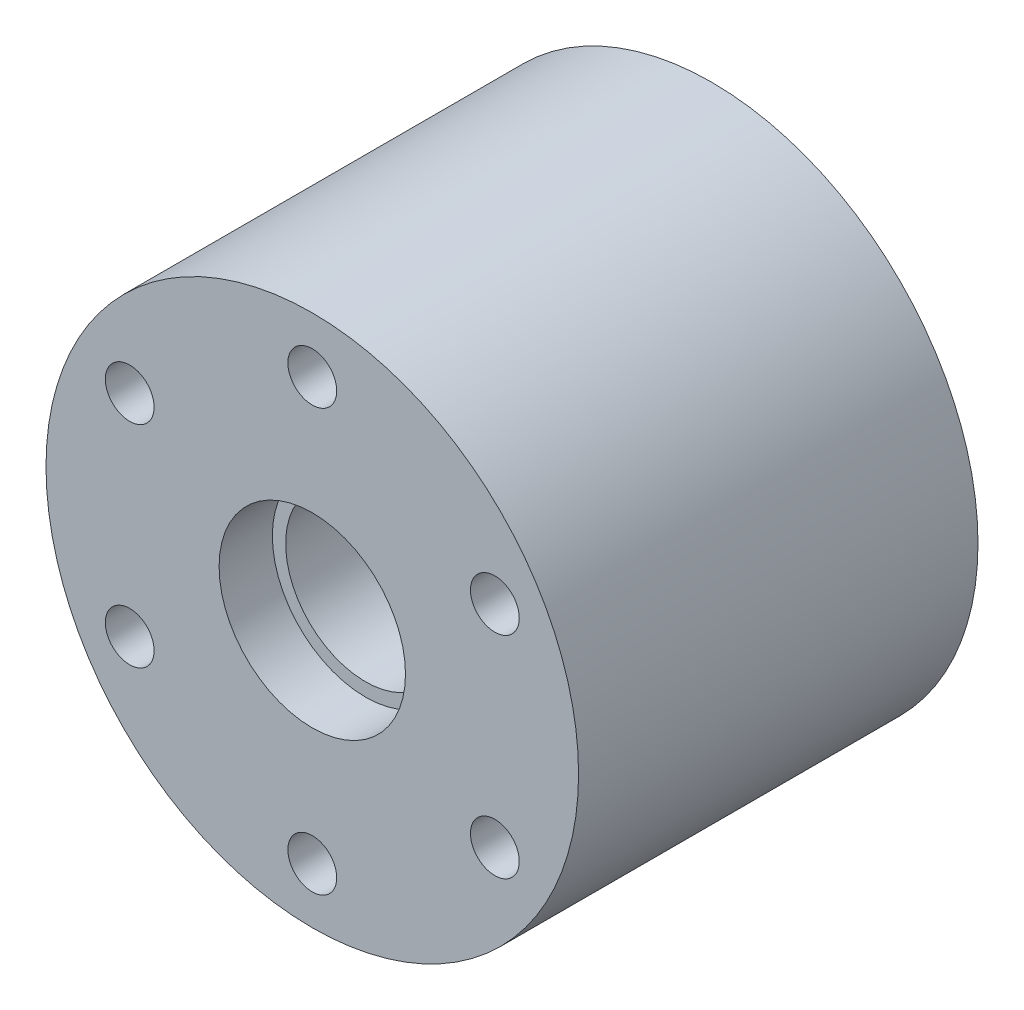
ISO-10303-21;
HEADER;
FILE_DESCRIPTION(('STEP AP214'),'2;1');
FILE_NAME('part.step','',(''),(''),'','','');
FILE_SCHEMA(('AUTOMOTIVE_DESIGN { 1 0 10303 214 1 1 1 1 }'));
ENDSEC;
DATA;
#1=APPLICATION_CONTEXT('core data for automotive mechanical design processes');
#2=APPLICATION_PROTOCOL_DEFINITION('international standard','automotive_design',2000,#1);
#3=PRODUCT_CONTEXT('',#1,'mechanical');
#4=PRODUCT('Part','Part','',(#3));
#5=PRODUCT_RELATED_PRODUCT_CATEGORY('part','',(#4));
#6=PRODUCT_DEFINITION_FORMATION('','',#4);
#7=PRODUCT_DEFINITION_CONTEXT('part definition',#1,'design');
#8=PRODUCT_DEFINITION('design','',#6,#7);
#9=PRODUCT_DEFINITION_SHAPE('','',#8);
#10=(LENGTH_UNIT() NAMED_UNIT(*) SI_UNIT(.MILLI.,.METRE.));
#11=(NAMED_UNIT(*) PLANE_ANGLE_UNIT() SI_UNIT($,.RADIAN.));
#12=(NAMED_UNIT(*) SI_UNIT($,.STERADIAN.) SOLID_ANGLE_UNIT());
#13=UNCERTAINTY_MEASURE_WITH_UNIT(LENGTH_MEASURE(1.E-05),#10,'distance_accuracy_value','');
#14=(GEOMETRIC_REPRESENTATION_CONTEXT(3) GLOBAL_UNCERTAINTY_ASSIGNED_CONTEXT((#13)) GLOBAL_UNIT_ASSIGNED_CONTEXT((#10,
#11,#12)) REPRESENTATION_CONTEXT('',''));
#15=CARTESIAN_POINT('',(0.,0.,0.));
#16=DIRECTION('',(0.,0.,1.));
#17=DIRECTION('',(1.,0.,0.));
#18=AXIS2_PLACEMENT_3D('',#15,#16,#17);
#19=CARTESIAN_POINT('',(0.,0.,45.));
#20=DIRECTION('',(0.,0.,-1.));
#21=DIRECTION('',(-1.,0.,0.));
#22=AXIS2_PLACEMENT_3D('',#19,#20,#21);
#23=CYLINDRICAL_SURFACE('',#22,9.);
#24=CARTESIAN_POINT('',(0.,0.,0.));
#25=DIRECTION('',(0.,0.,1.));
#26=DIRECTION('',(1.,0.,0.));
#27=AXIS2_PLACEMENT_3D('',#24,#25,#26);
#28=CIRCLE('',#27,9.);
#29=CARTESIAN_POINT('',(9.,0.,0.));
#30=VERTEX_POINT('',#29);
#31=EDGE_CURVE('E45',#30,#30,#28,.T.);
#32=ORIENTED_EDGE('',*,*,#31,.F.);
#33=EDGE_LOOP('',(#32));
#34=FACE_BOUND('',#33,.T.);
#35=CARTESIAN_POINT('',(0.,0.,39.));
#36=DIRECTION('',(0.,0.,1.));
#37=DIRECTION('',(1.,0.,0.));
#38=AXIS2_PLACEMENT_3D('',#35,#36,#37);
#39=CIRCLE('',#38,9.);
#40=CARTESIAN_POINT('',(9.,0.,39.));
#41=VERTEX_POINT('',#40);
#42=EDGE_CURVE('E36',#41,#41,#39,.T.);
#43=ORIENTED_EDGE('',*,*,#42,.T.);
#44=EDGE_LOOP('',(#43));
#45=FACE_BOUND('',#44,.T.);
#46=ADVANCED_FACE('F32',(#34,#45),#23,.F.);
#47=CARTESIAN_POINT('',(0.,0.,45.));
#48=DIRECTION('',(0.,0.,1.));
#49=DIRECTION('',(1.,0.,0.));
#50=AXIS2_PLACEMENT_3D('',#47,#48,#49);
#51=PLANE('',#50);
#52=CARTESIAN_POINT('',(0.,0.,45.));
#53=DIRECTION('',(0.,0.,1.));
#54=DIRECTION('',(1.,0.,0.));
#55=AXIS2_PLACEMENT_3D('',#52,#53,#54);
#56=CIRCLE('',#55,10.5);
#57=CARTESIAN_POINT('',(10.5,0.,45.));
#58=VERTEX_POINT('',#57);
#59=EDGE_CURVE('E85',#58,#58,#56,.T.);
#60=ORIENTED_EDGE('',*,*,#59,.F.);
#61=EDGE_LOOP('',(#60));
#62=FACE_BOUND('',#61,.T.);
#63=CARTESIAN_POINT('',(0.,23.75,45.));
#64=DIRECTION('',(0.,0.,1.));
#65=DIRECTION('',(1.,0.,0.));
#66=AXIS2_PLACEMENT_3D('',#63,#64,#65);
#67=CIRCLE('',#66,2.74999999999999);
#68=CARTESIAN_POINT('',(2.74999999999999,23.75,45.));
#69=VERTEX_POINT('',#68);
#70=EDGE_CURVE('E82',#69,#69,#67,.T.);
#71=ORIENTED_EDGE('',*,*,#70,.F.);
#72=EDGE_LOOP('',(#71));
#73=FACE_BOUND('',#72,.T.);
#74=CARTESIAN_POINT('',(20.5681033398811,11.8750000000012,45.));
#75=DIRECTION('',(0.,0.,1.));
#76=DIRECTION('',(1.,0.,0.));
#77=AXIS2_PLACEMENT_3D('',#74,#75,#76);
#78=CIRCLE('',#77,2.74999999999999);
#79=CARTESIAN_POINT('',(23.3181033398811,11.8750000000012,45.));
#80=VERTEX_POINT('',#79);
#81=EDGE_CURVE('E76',#80,#80,#78,.T.);
#82=ORIENTED_EDGE('',*,*,#81,.F.);
#83=EDGE_LOOP('',(#82));
#84=FACE_BOUND('',#83,.T.);
#85=CARTESIAN_POINT('',(20.5681033398824,-11.8749999999988,45.));
#86=DIRECTION('',(0.,0.,1.));
#87=DIRECTION('',(1.,0.,0.));
#88=AXIS2_PLACEMENT_3D('',#85,#86,#87);
#89=CIRCLE('',#88,2.74999999999999);
#90=CARTESIAN_POINT('',(23.3181033398824,-11.8749999999988,45.));
#91=VERTEX_POINT('',#90);
#92=EDGE_CURVE('E70',#91,#91,#89,.T.);
#93=ORIENTED_EDGE('',*,*,#92,.F.);
#94=EDGE_LOOP('',(#93));
#95=FACE_BOUND('',#94,.T.);
#96=CARTESIAN_POINT('',(2.69424532359243E-12,-23.75,45.));
#97=DIRECTION('',(0.,0.,1.));
#98=DIRECTION('',(1.,0.,0.));
#99=AXIS2_PLACEMENT_3D('',#96,#97,#98);
#100=CIRCLE('',#99,2.74999999999999);
#101=CARTESIAN_POINT('',(2.75000000000268,-23.75,45.));
#102=VERTEX_POINT('',#101);
#103=EDGE_CURVE('E64',#102,#102,#100,.T.);
#104=ORIENTED_EDGE('',*,*,#103,.F.);
#105=EDGE_LOOP('',(#104));
#106=FACE_BOUND('',#105,.T.);
#107=CARTESIAN_POINT('',(-20.5681033398784,-11.8750000000012,45.));
#108=DIRECTION('',(0.,0.,1.));
#109=DIRECTION('',(1.,0.,0.));
#110=AXIS2_PLACEMENT_3D('',#107,#108,#109);
#111=CIRCLE('',#110,2.74999999999999);
#112=CARTESIAN_POINT('',(-17.8181033398784,-11.8750000000012,45.));
#113=VERTEX_POINT('',#112);
#114=EDGE_CURVE('E58',#113,#113,#111,.T.);
#115=ORIENTED_EDGE('',*,*,#114,.F.);
#116=EDGE_LOOP('',(#115));
#117=FACE_BOUND('',#116,.T.);
#118=CARTESIAN_POINT('',(-20.5681033398797,11.8749999999988,45.));
#119=DIRECTION('',(0.,0.,1.));
#120=DIRECTION('',(1.,0.,0.));
#121=AXIS2_PLACEMENT_3D('',#118,#119,#120);
#122=CIRCLE('',#121,2.74999999999999);
#123=CARTESIAN_POINT('',(-17.8181033398798,11.8749999999988,45.));
#124=VERTEX_POINT('',#123);
#125=EDGE_CURVE('E52',#124,#124,#122,.T.);
#126=ORIENTED_EDGE('',*,*,#125,.F.);
#127=EDGE_LOOP('',(#126));
#128=FACE_BOUND('',#127,.T.);
#129=CARTESIAN_POINT('',(0.,0.,45.));
#130=DIRECTION('',(0.,0.,1.));
#131=DIRECTION('',(1.,0.,0.));
#132=AXIS2_PLACEMENT_3D('',#129,#130,#131);
#133=CIRCLE('',#132,30.);
#134=CARTESIAN_POINT('',(30.,0.,45.));
#135=VERTEX_POINT('',#134);
#136=EDGE_CURVE('E10',#135,#135,#133,.T.);
#137=ORIENTED_EDGE('',*,*,#136,.T.);
#138=EDGE_LOOP('',(#137));
#139=FACE_BOUND('',#138,.T.);
#140=ADVANCED_FACE('F107',(#62,#73,#84,#95,#106,#117,#128,#139),#51,.T.);
#141=CARTESIAN_POINT('',(0.,0.,0.));
#142=DIRECTION('',(0.,0.,1.));
#143=DIRECTION('',(1.,0.,0.));
#144=AXIS2_PLACEMENT_3D('',#141,#142,#143);
#145=PLANE('',#144);
#146=CARTESIAN_POINT('',(0.,23.75,0.));
#147=DIRECTION('',(0.,0.,1.));
#148=DIRECTION('',(1.,0.,0.));
#149=AXIS2_PLACEMENT_3D('',#146,#147,#148);
#150=CIRCLE('',#149,2.74999999999999);
#151=CARTESIAN_POINT('',(2.74999999999999,23.75,0.));
#152=VERTEX_POINT('',#151);
#153=EDGE_CURVE('E79',#152,#152,#150,.T.);
#154=ORIENTED_EDGE('',*,*,#153,.T.);
#155=EDGE_LOOP('',(#154));
#156=FACE_BOUND('',#155,.T.);
#157=CARTESIAN_POINT('',(20.5681033398811,11.8750000000012,0.));
#158=DIRECTION('',(0.,0.,1.));
#159=DIRECTION('',(1.,0.,0.));
#160=AXIS2_PLACEMENT_3D('',#157,#158,#159);
#161=CIRCLE('',#160,2.74999999999999);
#162=CARTESIAN_POINT('',(23.3181033398811,11.8750000000012,0.));
#163=VERTEX_POINT('',#162);
#164=EDGE_CURVE('E73',#163,#163,#161,.T.);
#165=ORIENTED_EDGE('',*,*,#164,.T.);
#166=EDGE_LOOP('',(#165));
#167=FACE_BOUND('',#166,.T.);
#168=CARTESIAN_POINT('',(20.5681033398824,-11.8749999999988,0.));
#169=DIRECTION('',(0.,0.,1.));
#170=DIRECTION('',(1.,0.,0.));
#171=AXIS2_PLACEMENT_3D('',#168,#169,#170);
#172=CIRCLE('',#171,2.74999999999999);
#173=CARTESIAN_POINT('',(23.3181033398824,-11.8749999999988,0.));
#174=VERTEX_POINT('',#173);
#175=EDGE_CURVE('E67',#174,#174,#172,.T.);
#176=ORIENTED_EDGE('',*,*,#175,.T.);
#177=EDGE_LOOP('',(#176));
#178=FACE_BOUND('',#177,.T.);
#179=CARTESIAN_POINT('',(2.69424532359243E-12,-23.75,0.));
#180=DIRECTION('',(0.,0.,1.));
#181=DIRECTION('',(1.,0.,0.));
#182=AXIS2_PLACEMENT_3D('',#179,#180,#181);
#183=CIRCLE('',#182,2.74999999999999);
#184=CARTESIAN_POINT('',(2.75000000000269,-23.75,0.));
#185=VERTEX_POINT('',#184);
#186=EDGE_CURVE('E61',#185,#185,#183,.T.);
#187=ORIENTED_EDGE('',*,*,#186,.T.);
#188=EDGE_LOOP('',(#187));
#189=FACE_BOUND('',#188,.T.);
#190=CARTESIAN_POINT('',(-20.5681033398784,-11.8750000000012,0.));
#191=DIRECTION('',(0.,0.,1.));
#192=DIRECTION('',(1.,0.,0.));
#193=AXIS2_PLACEMENT_3D('',#190,#191,#192);
#194=CIRCLE('',#193,2.74999999999999);
#195=CARTESIAN_POINT('',(-17.8181033398784,-11.8750000000012,0.));
#196=VERTEX_POINT('',#195);
#197=EDGE_CURVE('E55',#196,#196,#194,.T.);
#198=ORIENTED_EDGE('',*,*,#197,.T.);
#199=EDGE_LOOP('',(#198));
#200=FACE_BOUND('',#199,.T.);
#201=CARTESIAN_POINT('',(-20.5681033398797,11.8749999999988,0.));
#202=DIRECTION('',(0.,0.,1.));
#203=DIRECTION('',(1.,0.,0.));
#204=AXIS2_PLACEMENT_3D('',#201,#202,#203);
#205=CIRCLE('',#204,2.74999999999999);
#206=CARTESIAN_POINT('',(-17.8181033398798,11.8749999999988,0.));
#207=VERTEX_POINT('',#206);
#208=EDGE_CURVE('E49',#207,#207,#205,.T.);
#209=ORIENTED_EDGE('',*,*,#208,.T.);
#210=EDGE_LOOP('',(#209));
#211=FACE_BOUND('',#210,.T.);
#212=CARTESIAN_POINT('',(0.,0.,0.));
#213=DIRECTION('',(0.,0.,1.));
#214=DIRECTION('',(1.,0.,0.));
#215=AXIS2_PLACEMENT_3D('',#212,#213,#214);
#216=CIRCLE('',#215,30.);
#217=CARTESIAN_POINT('',(30.,0.,0.));
#218=VERTEX_POINT('',#217);
#219=EDGE_CURVE('E40',#218,#218,#216,.T.);
#220=ORIENTED_EDGE('',*,*,#219,.F.);
#221=EDGE_LOOP('',(#220));
#222=FACE_BOUND('',#221,.T.);
#223=ORIENTED_EDGE('',*,*,#31,.T.);
#224=EDGE_LOOP('',(#223));
#225=FACE_BOUND('',#224,.T.);
#226=ADVANCED_FACE('F113',(#156,#167,#178,#189,#200,#211,#222,#225),#145,.F.);
#227=CARTESIAN_POINT('',(0.,0.,45.));
#228=DIRECTION('',(0.,0.,-1.));
#229=DIRECTION('',(-1.,0.,0.));
#230=AXIS2_PLACEMENT_3D('',#227,#228,#229);
#231=CYLINDRICAL_SURFACE('',#230,30.);
#232=ORIENTED_EDGE('',*,*,#136,.F.);
#233=EDGE_LOOP('',(#232));
#234=FACE_BOUND('',#233,.T.);
#235=ORIENTED_EDGE('',*,*,#219,.T.);
#236=EDGE_LOOP('',(#235));
#237=FACE_BOUND('',#236,.T.);
#238=ADVANCED_FACE('F34',(#234,#237),#231,.T.);
#239=CARTESIAN_POINT('',(-20.5681033398797,11.8749999999988,45.));
#240=DIRECTION('',(0.,0.,1.));
#241=DIRECTION('',(1.,0.,0.));
#242=AXIS2_PLACEMENT_3D('',#239,#240,#241);
#243=CYLINDRICAL_SURFACE('',#242,2.74999999999999);
#244=ORIENTED_EDGE('',*,*,#208,.F.);
#245=EDGE_LOOP('',(#244));
#246=FACE_BOUND('',#245,.T.);
#247=ORIENTED_EDGE('',*,*,#125,.T.);
#248=EDGE_LOOP('',(#247));
#249=FACE_BOUND('',#248,.T.);
#250=ADVANCED_FACE('F118',(#246,#249),#243,.F.);
#251=CARTESIAN_POINT('',(-20.5681033398784,-11.8750000000012,45.));
#252=DIRECTION('',(0.,0.,1.));
#253=DIRECTION('',(1.,0.,0.));
#254=AXIS2_PLACEMENT_3D('',#251,#252,#253);
#255=CYLINDRICAL_SURFACE('',#254,2.74999999999999);
#256=ORIENTED_EDGE('',*,*,#197,.F.);
#257=EDGE_LOOP('',(#256));
#258=FACE_BOUND('',#257,.T.);
#259=ORIENTED_EDGE('',*,*,#114,.T.);
#260=EDGE_LOOP('',(#259));
#261=FACE_BOUND('',#260,.T.);
#262=ADVANCED_FACE('F144',(#258,#261),#255,.F.);
#263=CARTESIAN_POINT('',(2.69424532359243E-12,-23.75,45.));
#264=DIRECTION('',(0.,0.,1.));
#265=DIRECTION('',(1.,0.,0.));
#266=AXIS2_PLACEMENT_3D('',#263,#264,#265);
#267=CYLINDRICAL_SURFACE('',#266,2.74999999999999);
#268=ORIENTED_EDGE('',*,*,#186,.F.);
#269=EDGE_LOOP('',(#268));
#270=FACE_BOUND('',#269,.T.);
#271=ORIENTED_EDGE('',*,*,#103,.T.);
#272=EDGE_LOOP('',(#271));
#273=FACE_BOUND('',#272,.T.);
#274=ADVANCED_FACE('F150',(#270,#273),#267,.F.);
#275=CARTESIAN_POINT('',(20.5681033398824,-11.8749999999988,45.));
#276=DIRECTION('',(0.,0.,1.));
#277=DIRECTION('',(1.,0.,0.));
#278=AXIS2_PLACEMENT_3D('',#275,#276,#277);
#279=CYLINDRICAL_SURFACE('',#278,2.74999999999999);
#280=ORIENTED_EDGE('',*,*,#175,.F.);
#281=EDGE_LOOP('',(#280));
#282=FACE_BOUND('',#281,.T.);
#283=ORIENTED_EDGE('',*,*,#92,.T.);
#284=EDGE_LOOP('',(#283));
#285=FACE_BOUND('',#284,.T.);
#286=ADVANCED_FACE('F155',(#282,#285),#279,.F.);
#287=CARTESIAN_POINT('',(20.5681033398811,11.8750000000012,45.));
#288=DIRECTION('',(0.,0.,1.));
#289=DIRECTION('',(1.,0.,0.));
#290=AXIS2_PLACEMENT_3D('',#287,#288,#289);
#291=CYLINDRICAL_SURFACE('',#290,2.74999999999999);
#292=ORIENTED_EDGE('',*,*,#164,.F.);
#293=EDGE_LOOP('',(#292));
#294=FACE_BOUND('',#293,.T.);
#295=ORIENTED_EDGE('',*,*,#81,.T.);
#296=EDGE_LOOP('',(#295));
#297=FACE_BOUND('',#296,.T.);
#298=ADVANCED_FACE('F162',(#294,#297),#291,.F.);
#299=CARTESIAN_POINT('',(0.,23.75,45.));
#300=DIRECTION('',(0.,0.,1.));
#301=DIRECTION('',(1.,0.,0.));
#302=AXIS2_PLACEMENT_3D('',#299,#300,#301);
#303=CYLINDRICAL_SURFACE('',#302,2.74999999999999);
#304=ORIENTED_EDGE('',*,*,#153,.F.);
#305=EDGE_LOOP('',(#304));
#306=FACE_BOUND('',#305,.T.);
#307=ORIENTED_EDGE('',*,*,#70,.T.);
#308=EDGE_LOOP('',(#307));
#309=FACE_BOUND('',#308,.T.);
#310=ADVANCED_FACE('F103',(#306,#309),#303,.F.);
#311=CARTESIAN_POINT('',(0.,0.,39.));
#312=DIRECTION('',(0.,0.,1.));
#313=DIRECTION('',(1.,0.,0.));
#314=AXIS2_PLACEMENT_3D('',#311,#312,#313);
#315=CYLINDRICAL_SURFACE('',#314,10.5);
#316=CARTESIAN_POINT('',(0.,0.,39.));
#317=DIRECTION('',(0.,0.,1.));
#318=DIRECTION('',(1.,0.,0.));
#319=AXIS2_PLACEMENT_3D('',#316,#317,#318);
#320=CIRCLE('',#319,10.5);
#321=CARTESIAN_POINT('',(10.5,0.,39.));
#322=VERTEX_POINT('',#321);
#323=EDGE_CURVE('E88',#322,#322,#320,.T.);
#324=ORIENTED_EDGE('',*,*,#323,.F.);
#325=EDGE_LOOP('',(#324));
#326=FACE_BOUND('',#325,.T.);
#327=ORIENTED_EDGE('',*,*,#59,.T.);
#328=EDGE_LOOP('',(#327));
#329=FACE_BOUND('',#328,.T.);
#330=ADVANCED_FACE('F98',(#326,#329),#315,.F.);
#331=CARTESIAN_POINT('',(0.,0.,39.));
#332=DIRECTION('',(0.,0.,1.));
#333=DIRECTION('',(1.,0.,0.));
#334=AXIS2_PLACEMENT_3D('',#331,#332,#333);
#335=PLANE('',#334);
#336=ORIENTED_EDGE('',*,*,#42,.F.);
#337=EDGE_LOOP('',(#336));
#338=FACE_BOUND('',#337,.T.);
#339=ORIENTED_EDGE('',*,*,#323,.T.);
#340=EDGE_LOOP('',(#339));
#341=FACE_BOUND('',#340,.T.);
#342=ADVANCED_FACE('F96',(#338,#341),#335,.T.);
#343=CLOSED_SHELL('',(#46,#140,#226,#238,#250,#262,#274,#286,#298,#310,#330,#342));
#344=MANIFOLD_SOLID_BREP('B2',#343);
#345=ADVANCED_BREP_SHAPE_REPRESENTATION('',(#18,#344),#14);
#346=SHAPE_DEFINITION_REPRESENTATION(#9,#345);
ENDSEC;
END-ISO-10303-21;
